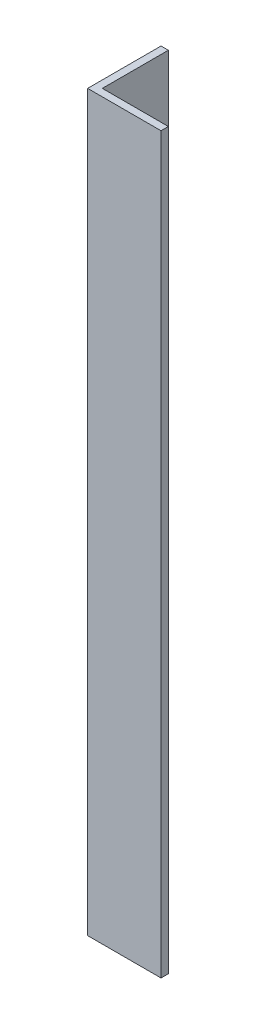
ISO-10303-21;
HEADER;
FILE_DESCRIPTION(('STEP AP214'),'2;1');
FILE_NAME('part.step','',(''),(''),'','','');
FILE_SCHEMA(('AUTOMOTIVE_DESIGN { 1 0 10303 214 1 1 1 1 }'));
ENDSEC;
DATA;
#1=APPLICATION_CONTEXT('core data for automotive mechanical design processes');
#2=APPLICATION_PROTOCOL_DEFINITION('international standard','automotive_design',2000,#1);
#3=PRODUCT_CONTEXT('',#1,'mechanical');
#4=PRODUCT('Part','Part','',(#3));
#5=PRODUCT_RELATED_PRODUCT_CATEGORY('part','',(#4));
#6=PRODUCT_DEFINITION_FORMATION('','',#4);
#7=PRODUCT_DEFINITION_CONTEXT('part definition',#1,'design');
#8=PRODUCT_DEFINITION('design','',#6,#7);
#9=PRODUCT_DEFINITION_SHAPE('','',#8);
#10=(LENGTH_UNIT() NAMED_UNIT(*) SI_UNIT(.MILLI.,.METRE.));
#11=(NAMED_UNIT(*) PLANE_ANGLE_UNIT() SI_UNIT($,.RADIAN.));
#12=(NAMED_UNIT(*) SI_UNIT($,.STERADIAN.) SOLID_ANGLE_UNIT());
#13=UNCERTAINTY_MEASURE_WITH_UNIT(LENGTH_MEASURE(1.E-05),#10,'distance_accuracy_value','');
#14=(GEOMETRIC_REPRESENTATION_CONTEXT(3) GLOBAL_UNCERTAINTY_ASSIGNED_CONTEXT((#13)) GLOBAL_UNIT_ASSIGNED_CONTEXT((#10,
#11,#12)) REPRESENTATION_CONTEXT('',''));
#15=CARTESIAN_POINT('',(0.,0.,0.));
#16=DIRECTION('',(0.,0.,1.));
#17=DIRECTION('',(1.,0.,0.));
#18=AXIS2_PLACEMENT_3D('',#15,#16,#17);
#19=CARTESIAN_POINT('',(0.,400.,0.));
#20=DIRECTION('',(0.,0.,-1.));
#21=DIRECTION('',(-1.,0.,0.));
#22=AXIS2_PLACEMENT_3D('',#19,#20,#21);
#23=PLANE('',#22);
#24=DIRECTION('',(1.,0.,0.));
#25=VECTOR('',#24,1.);
#26=CARTESIAN_POINT('',(0.,0.,0.));
#27=LINE('',#26,#25);
#28=CARTESIAN_POINT('',(0.,0.,0.));
#29=VERTEX_POINT('',#28);
#30=CARTESIAN_POINT('',(40.,0.,0.));
#31=VERTEX_POINT('',#30);
#32=EDGE_CURVE('E115',#29,#31,#27,.T.);
#33=ORIENTED_EDGE('',*,*,#32,.T.);
#34=DIRECTION('',(0.,-1.,0.));
#35=VECTOR('',#34,1.);
#36=CARTESIAN_POINT('',(40.,400.,0.));
#37=LINE('',#36,#35);
#38=CARTESIAN_POINT('',(40.,400.,0.));
#39=VERTEX_POINT('',#38);
#40=EDGE_CURVE('E11',#39,#31,#37,.T.);
#41=ORIENTED_EDGE('',*,*,#40,.F.);
#42=DIRECTION('',(1.,0.,0.));
#43=VECTOR('',#42,1.);
#44=CARTESIAN_POINT('',(0.,400.,0.));
#45=LINE('',#44,#43);
#46=CARTESIAN_POINT('',(0.,400.,0.));
#47=VERTEX_POINT('',#46);
#48=EDGE_CURVE('E80',#47,#39,#45,.T.);
#49=ORIENTED_EDGE('',*,*,#48,.F.);
#50=DIRECTION('',(0.,-1.,0.));
#51=VECTOR('',#50,1.);
#52=CARTESIAN_POINT('',(0.,400.,0.));
#53=LINE('',#52,#51);
#54=EDGE_CURVE('E111',#47,#29,#53,.T.);
#55=ORIENTED_EDGE('',*,*,#54,.T.);
#56=EDGE_LOOP('',(#33,#41,#49,#55));
#57=FACE_BOUND('',#56,.T.);
#58=ADVANCED_FACE('F34',(#57),#23,.F.);
#59=CARTESIAN_POINT('',(40.,400.,-4.));
#60=DIRECTION('',(1.,0.,0.));
#61=DIRECTION('',(0.,0.,-1.));
#62=AXIS2_PLACEMENT_3D('',#59,#60,#61);
#63=PLANE('',#62);
#64=DIRECTION('',(0.,0.,1.));
#65=VECTOR('',#64,1.);
#66=CARTESIAN_POINT('',(40.,0.,-4.));
#67=LINE('',#66,#65);
#68=CARTESIAN_POINT('',(40.,0.,-4.));
#69=VERTEX_POINT('',#68);
#70=EDGE_CURVE('E118',#69,#31,#67,.T.);
#71=ORIENTED_EDGE('',*,*,#70,.F.);
#72=DIRECTION('',(0.,-1.,0.));
#73=VECTOR('',#72,1.);
#74=CARTESIAN_POINT('',(40.,400.,-4.));
#75=LINE('',#74,#73);
#76=CARTESIAN_POINT('',(40.,400.,-4.));
#77=VERTEX_POINT('',#76);
#78=EDGE_CURVE('E42',#77,#69,#75,.T.);
#79=ORIENTED_EDGE('',*,*,#78,.F.);
#80=DIRECTION('',(0.,0.,1.));
#81=VECTOR('',#80,1.);
#82=CARTESIAN_POINT('',(40.,400.,-4.));
#83=LINE('',#82,#81);
#84=EDGE_CURVE('E204',#77,#39,#83,.T.);
#85=ORIENTED_EDGE('',*,*,#84,.T.);
#86=ORIENTED_EDGE('',*,*,#40,.T.);
#87=EDGE_LOOP('',(#71,#79,#85,#86));
#88=FACE_BOUND('',#87,.T.);
#89=ADVANCED_FACE('F136',(#88),#63,.T.);
#90=CARTESIAN_POINT('',(0.,400.,-4.));
#91=DIRECTION('',(0.,0.,-1.));
#92=DIRECTION('',(-1.,0.,0.));
#93=AXIS2_PLACEMENT_3D('',#90,#91,#92);
#94=PLANE('',#93);
#95=DIRECTION('',(1.,0.,0.));
#96=VECTOR('',#95,1.);
#97=CARTESIAN_POINT('',(0.,0.,-4.));
#98=LINE('',#97,#96);
#99=CARTESIAN_POINT('',(4.,0.,-4.));
#100=VERTEX_POINT('',#99);
#101=EDGE_CURVE('E121',#100,#69,#98,.T.);
#102=ORIENTED_EDGE('',*,*,#101,.F.);
#103=DIRECTION('',(0.,-1.,0.));
#104=VECTOR('',#103,1.);
#105=CARTESIAN_POINT('',(4.,400.,-4.));
#106=LINE('',#105,#104);
#107=CARTESIAN_POINT('',(4.,400.,-4.));
#108=VERTEX_POINT('',#107);
#109=EDGE_CURVE('E101',#108,#100,#106,.T.);
#110=ORIENTED_EDGE('',*,*,#109,.F.);
#111=DIRECTION('',(1.,0.,0.));
#112=VECTOR('',#111,1.);
#113=CARTESIAN_POINT('',(0.,400.,-4.));
#114=LINE('',#113,#112);
#115=EDGE_CURVE('E107',#108,#77,#114,.T.);
#116=ORIENTED_EDGE('',*,*,#115,.T.);
#117=ORIENTED_EDGE('',*,*,#78,.T.);
#118=EDGE_LOOP('',(#102,#110,#116,#117));
#119=FACE_BOUND('',#118,.T.);
#120=ADVANCED_FACE('F133',(#119),#94,.T.);
#121=CARTESIAN_POINT('',(4.,400.,-40.));
#122=DIRECTION('',(1.,0.,0.));
#123=DIRECTION('',(0.,0.,-1.));
#124=AXIS2_PLACEMENT_3D('',#121,#122,#123);
#125=PLANE('',#124);
#126=DIRECTION('',(0.,0.,1.));
#127=VECTOR('',#126,1.);
#128=CARTESIAN_POINT('',(4.,0.,-40.));
#129=LINE('',#128,#127);
#130=CARTESIAN_POINT('',(4.,0.,-40.));
#131=VERTEX_POINT('',#130);
#132=EDGE_CURVE('E96',#131,#100,#129,.T.);
#133=ORIENTED_EDGE('',*,*,#132,.F.);
#134=DIRECTION('',(0.,-1.,0.));
#135=VECTOR('',#134,1.);
#136=CARTESIAN_POINT('',(4.,400.,-40.));
#137=LINE('',#136,#135);
#138=CARTESIAN_POINT('',(4.,400.,-40.));
#139=VERTEX_POINT('',#138);
#140=EDGE_CURVE('E91',#139,#131,#137,.T.);
#141=ORIENTED_EDGE('',*,*,#140,.F.);
#142=DIRECTION('',(0.,0.,1.));
#143=VECTOR('',#142,1.);
#144=CARTESIAN_POINT('',(4.,400.,-40.));
#145=LINE('',#144,#143);
#146=EDGE_CURVE('E94',#139,#108,#145,.T.);
#147=ORIENTED_EDGE('',*,*,#146,.T.);
#148=ORIENTED_EDGE('',*,*,#109,.T.);
#149=EDGE_LOOP('',(#133,#141,#147,#148));
#150=FACE_BOUND('',#149,.T.);
#151=ADVANCED_FACE('F93',(#150),#125,.T.);
#152=CARTESIAN_POINT('',(0.,400.,-40.));
#153=DIRECTION('',(0.,0.,-1.));
#154=DIRECTION('',(-1.,0.,0.));
#155=AXIS2_PLACEMENT_3D('',#152,#153,#154);
#156=PLANE('',#155);
#157=DIRECTION('',(1.,0.,0.));
#158=VECTOR('',#157,1.);
#159=CARTESIAN_POINT('',(0.,0.,-40.));
#160=LINE('',#159,#158);
#161=CARTESIAN_POINT('',(0.,0.,-40.));
#162=VERTEX_POINT('',#161);
#163=EDGE_CURVE('E125',#162,#131,#160,.T.);
#164=ORIENTED_EDGE('',*,*,#163,.F.);
#165=DIRECTION('',(0.,-1.,0.));
#166=VECTOR('',#165,1.);
#167=CARTESIAN_POINT('',(0.,400.,-40.));
#168=LINE('',#167,#166);
#169=CARTESIAN_POINT('',(0.,400.,-40.));
#170=VERTEX_POINT('',#169);
#171=EDGE_CURVE('E71',#170,#162,#168,.T.);
#172=ORIENTED_EDGE('',*,*,#171,.F.);
#173=DIRECTION('',(1.,0.,0.));
#174=VECTOR('',#173,1.);
#175=CARTESIAN_POINT('',(0.,400.,-40.));
#176=LINE('',#175,#174);
#177=EDGE_CURVE('E105',#170,#139,#176,.T.);
#178=ORIENTED_EDGE('',*,*,#177,.T.);
#179=ORIENTED_EDGE('',*,*,#140,.T.);
#180=EDGE_LOOP('',(#164,#172,#178,#179));
#181=FACE_BOUND('',#180,.T.);
#182=ADVANCED_FACE('F109',(#181),#156,.T.);
#183=CARTESIAN_POINT('',(0.,400.,-40.));
#184=DIRECTION('',(1.,0.,0.));
#185=DIRECTION('',(0.,0.,-1.));
#186=AXIS2_PLACEMENT_3D('',#183,#184,#185);
#187=PLANE('',#186);
#188=DIRECTION('',(0.,0.,1.));
#189=VECTOR('',#188,1.);
#190=CARTESIAN_POINT('',(0.,0.,-40.));
#191=LINE('',#190,#189);
#192=EDGE_CURVE('E74',#162,#29,#191,.T.);
#193=ORIENTED_EDGE('',*,*,#192,.T.);
#194=ORIENTED_EDGE('',*,*,#54,.F.);
#195=DIRECTION('',(0.,0.,1.));
#196=VECTOR('',#195,1.);
#197=CARTESIAN_POINT('',(0.,400.,-40.));
#198=LINE('',#197,#196);
#199=EDGE_CURVE('E50',#170,#47,#198,.T.);
#200=ORIENTED_EDGE('',*,*,#199,.F.);
#201=ORIENTED_EDGE('',*,*,#171,.T.);
#202=EDGE_LOOP('',(#193,#194,#200,#201));
#203=FACE_BOUND('',#202,.T.);
#204=ADVANCED_FACE('F141',(#203),#187,.F.);
#205=CARTESIAN_POINT('',(0.,400.,0.));
#206=DIRECTION('',(0.,-1.,0.));
#207=DIRECTION('',(-1.,0.,0.));
#208=AXIS2_PLACEMENT_3D('',#205,#206,#207);
#209=PLANE('',#208);
#210=ORIENTED_EDGE('',*,*,#48,.T.);
#211=ORIENTED_EDGE('',*,*,#84,.F.);
#212=ORIENTED_EDGE('',*,*,#115,.F.);
#213=ORIENTED_EDGE('',*,*,#146,.F.);
#214=ORIENTED_EDGE('',*,*,#177,.F.);
#215=ORIENTED_EDGE('',*,*,#199,.T.);
#216=EDGE_LOOP('',(#210,#211,#212,#213,#214,#215));
#217=FACE_BOUND('',#216,.T.);
#218=ADVANCED_FACE('F104',(#217),#209,.F.);
#219=CARTESIAN_POINT('',(0.,0.,0.));
#220=DIRECTION('',(0.,-1.,0.));
#221=DIRECTION('',(-1.,0.,0.));
#222=AXIS2_PLACEMENT_3D('',#219,#220,#221);
#223=PLANE('',#222);
#224=ORIENTED_EDGE('',*,*,#32,.F.);
#225=ORIENTED_EDGE('',*,*,#192,.F.);
#226=ORIENTED_EDGE('',*,*,#163,.T.);
#227=ORIENTED_EDGE('',*,*,#132,.T.);
#228=ORIENTED_EDGE('',*,*,#101,.T.);
#229=ORIENTED_EDGE('',*,*,#70,.T.);
#230=EDGE_LOOP('',(#224,#225,#226,#227,#228,#229));
#231=FACE_BOUND('',#230,.T.);
#232=ADVANCED_FACE('F139',(#231),#223,.T.);
#233=CLOSED_SHELL('',(#58,#89,#120,#151,#182,#204,#218,#232));
#234=MANIFOLD_SOLID_BREP('B2',#233);
#235=ADVANCED_BREP_SHAPE_REPRESENTATION('',(#18,#234),#14);
#236=SHAPE_DEFINITION_REPRESENTATION(#9,#235);
ENDSEC;
END-ISO-10303-21;
